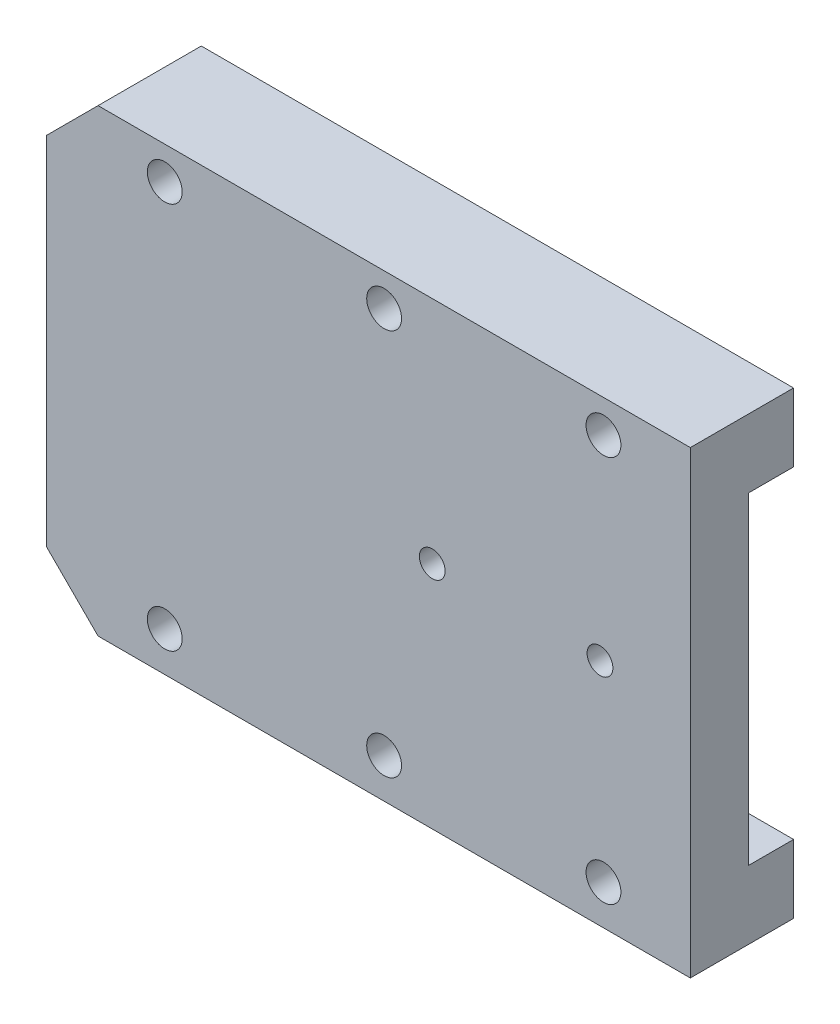
ISO-10303-21;
HEADER;
FILE_DESCRIPTION(('STEP AP214'),'2;1');
FILE_NAME('part.step','',(''),(''),'','','');
FILE_SCHEMA(('AUTOMOTIVE_DESIGN { 1 0 10303 214 1 1 1 1 }'));
ENDSEC;
DATA;
#1=APPLICATION_CONTEXT('core data for automotive mechanical design processes');
#2=APPLICATION_PROTOCOL_DEFINITION('international standard','automotive_design',2000,#1);
#3=PRODUCT_CONTEXT('',#1,'mechanical');
#4=PRODUCT('Part','Part','',(#3));
#5=PRODUCT_RELATED_PRODUCT_CATEGORY('part','',(#4));
#6=PRODUCT_DEFINITION_FORMATION('','',#4);
#7=PRODUCT_DEFINITION_CONTEXT('part definition',#1,'design');
#8=PRODUCT_DEFINITION('design','',#6,#7);
#9=PRODUCT_DEFINITION_SHAPE('','',#8);
#10=(LENGTH_UNIT() NAMED_UNIT(*) SI_UNIT(.MILLI.,.METRE.));
#11=(NAMED_UNIT(*) PLANE_ANGLE_UNIT() SI_UNIT($,.RADIAN.));
#12=(NAMED_UNIT(*) SI_UNIT($,.STERADIAN.) SOLID_ANGLE_UNIT());
#13=UNCERTAINTY_MEASURE_WITH_UNIT(LENGTH_MEASURE(1.E-05),#10,'distance_accuracy_value','');
#14=(GEOMETRIC_REPRESENTATION_CONTEXT(3) GLOBAL_UNCERTAINTY_ASSIGNED_CONTEXT((#13)) GLOBAL_UNIT_ASSIGNED_CONTEXT((#10,
#11,#12)) REPRESENTATION_CONTEXT('',''));
#15=CARTESIAN_POINT('',(0.,0.,0.));
#16=DIRECTION('',(0.,0.,1.));
#17=DIRECTION('',(1.,0.,0.));
#18=AXIS2_PLACEMENT_3D('',#15,#16,#17);
#19=CARTESIAN_POINT('',(0.,0.,-4.));
#20=DIRECTION('',(0.,0.,-1.));
#21=DIRECTION('',(-1.,0.,0.));
#22=AXIS2_PLACEMENT_3D('',#19,#20,#21);
#23=PLANE('',#22);
#24=DIRECTION('',(-1.,0.,0.));
#25=VECTOR('',#24,1.);
#26=CARTESIAN_POINT('',(22.5,12.5,-4.));
#27=LINE('',#26,#25);
#28=CARTESIAN_POINT('',(22.5,12.5,-4.));
#29=VERTEX_POINT('',#28);
#30=CARTESIAN_POINT('',(-27.4,12.5,-4.));
#31=VERTEX_POINT('',#30);
#32=EDGE_CURVE('E170',#29,#31,#27,.T.);
#33=ORIENTED_EDGE('',*,*,#32,.T.);
#34=DIRECTION('',(0.,1.,0.));
#35=VECTOR('',#34,1.);
#36=CARTESIAN_POINT('',(-27.4,17.8,-4.));
#37=LINE('',#36,#35);
#38=CARTESIAN_POINT('',(-27.4,13.8,-4.));
#39=VERTEX_POINT('',#38);
#40=EDGE_CURVE('E173',#31,#39,#37,.T.);
#41=ORIENTED_EDGE('',*,*,#40,.T.);
#42=DIRECTION('',(0.707106781186549,0.707106781186546,0.));
#43=VECTOR('',#42,1.);
#44=CARTESIAN_POINT('',(-20.6,20.6,-4.));
#45=LINE('',#44,#43);
#46=CARTESIAN_POINT('',(-23.4,17.8,-4.));
#47=VERTEX_POINT('',#46);
#48=EDGE_CURVE('E143',#39,#47,#45,.T.);
#49=ORIENTED_EDGE('',*,*,#48,.T.);
#50=DIRECTION('',(-1.,0.,0.));
#51=VECTOR('',#50,1.);
#52=CARTESIAN_POINT('',(22.5,17.8,-4.));
#53=LINE('',#52,#51);
#54=CARTESIAN_POINT('',(22.5,17.8,-4.));
#55=VERTEX_POINT('',#54);
#56=EDGE_CURVE('E121',#55,#47,#53,.T.);
#57=ORIENTED_EDGE('',*,*,#56,.F.);
#58=DIRECTION('',(0.,1.,0.));
#59=VECTOR('',#58,1.);
#60=CARTESIAN_POINT('',(22.5,17.8,-4.));
#61=LINE('',#60,#59);
#62=EDGE_CURVE('E122',#29,#55,#61,.T.);
#63=ORIENTED_EDGE('',*,*,#62,.F.);
#64=EDGE_LOOP('',(#33,#41,#49,#57,#63));
#65=FACE_BOUND('',#64,.T.);
#66=CARTESIAN_POINT('',(-18.2306151546301,15.26709885284,-4.));
#67=DIRECTION('',(0.,0.,-1.));
#68=DIRECTION('',(-1.,0.,0.));
#69=AXIS2_PLACEMENT_3D('',#66,#67,#68);
#70=CIRCLE('',#69,1.35);
#71=CARTESIAN_POINT('',(-19.5806151546301,15.26709885284,-4.));
#72=VERTEX_POINT('',#71);
#73=EDGE_CURVE('E190',#72,#72,#70,.T.);
#74=ORIENTED_EDGE('',*,*,#73,.F.);
#75=EDGE_LOOP('',(#74));
#76=FACE_BOUND('',#75,.T.);
#77=CARTESIAN_POINT('',(-1.23061515463011,15.2670988528399,-4.));
#78=DIRECTION('',(0.,0.,-1.));
#79=DIRECTION('',(-1.,0.,0.));
#80=AXIS2_PLACEMENT_3D('',#77,#78,#79);
#81=CIRCLE('',#80,1.35);
#82=CARTESIAN_POINT('',(-2.58061515463011,15.2670988528399,-4.));
#83=VERTEX_POINT('',#82);
#84=EDGE_CURVE('E184',#83,#83,#81,.T.);
#85=ORIENTED_EDGE('',*,*,#84,.F.);
#86=EDGE_LOOP('',(#85));
#87=FACE_BOUND('',#86,.T.);
#88=CARTESIAN_POINT('',(15.7693848453699,15.2670988528398,-4.));
#89=DIRECTION('',(0.,0.,-1.));
#90=DIRECTION('',(-1.,0.,0.));
#91=AXIS2_PLACEMENT_3D('',#88,#89,#90);
#92=CIRCLE('',#91,1.35);
#93=CARTESIAN_POINT('',(14.4193848453699,15.2670988528398,-4.));
#94=VERTEX_POINT('',#93);
#95=EDGE_CURVE('E179',#94,#94,#92,.T.);
#96=ORIENTED_EDGE('',*,*,#95,.F.);
#97=EDGE_LOOP('',(#96));
#98=FACE_BOUND('',#97,.T.);
#99=ADVANCED_FACE('F16',(#65,#76,#87,#98),#23,.T.);
#100=CARTESIAN_POINT('',(22.5,-17.8,4.));
#101=DIRECTION('',(0.,1.,0.));
#102=DIRECTION('',(-1.,0.,0.));
#103=AXIS2_PLACEMENT_3D('',#100,#101,#102);
#104=PLANE('',#103);
#105=DIRECTION('',(1.,0.,0.));
#106=VECTOR('',#105,1.);
#107=CARTESIAN_POINT('',(22.5,-17.8,4.));
#108=LINE('',#107,#106);
#109=CARTESIAN_POINT('',(-23.4,-17.8,4.));
#110=VERTEX_POINT('',#109);
#111=CARTESIAN_POINT('',(22.5,-17.8,4.));
#112=VERTEX_POINT('',#111);
#113=EDGE_CURVE('E125',#110,#112,#108,.T.);
#114=ORIENTED_EDGE('',*,*,#113,.F.);
#115=DIRECTION('',(0.,0.,-1.));
#116=VECTOR('',#115,1.);
#117=CARTESIAN_POINT('',(-23.4,-17.8,-4.));
#118=LINE('',#117,#116);
#119=CARTESIAN_POINT('',(-23.4,-17.8,-4.));
#120=VERTEX_POINT('',#119);
#121=EDGE_CURVE('E11',#110,#120,#118,.T.);
#122=ORIENTED_EDGE('',*,*,#121,.T.);
#123=DIRECTION('',(1.,0.,0.));
#124=VECTOR('',#123,1.);
#125=CARTESIAN_POINT('',(22.5,-17.8,-4.));
#126=LINE('',#125,#124);
#127=CARTESIAN_POINT('',(22.5,-17.8,-4.));
#128=VERTEX_POINT('',#127);
#129=EDGE_CURVE('E127',#120,#128,#126,.T.);
#130=ORIENTED_EDGE('',*,*,#129,.T.);
#131=DIRECTION('',(0.,0.,-1.));
#132=VECTOR('',#131,1.);
#133=CARTESIAN_POINT('',(22.5,-17.8,4.));
#134=LINE('',#133,#132);
#135=EDGE_CURVE('E120',#112,#128,#134,.T.);
#136=ORIENTED_EDGE('',*,*,#135,.F.);
#137=EDGE_LOOP('',(#114,#122,#130,#136));
#138=FACE_BOUND('',#137,.T.);
#139=ADVANCED_FACE('F238',(#138),#104,.F.);
#140=CARTESIAN_POINT('',(22.5,17.8,4.));
#141=DIRECTION('',(-1.,0.,0.));
#142=DIRECTION('',(0.,0.,1.));
#143=AXIS2_PLACEMENT_3D('',#140,#141,#142);
#144=PLANE('',#143);
#145=DIRECTION('',(0.,1.,0.));
#146=VECTOR('',#145,1.);
#147=CARTESIAN_POINT('',(22.5,12.5,-0.5));
#148=LINE('',#147,#146);
#149=CARTESIAN_POINT('',(22.5,-12.5,-0.5));
#150=VERTEX_POINT('',#149);
#151=CARTESIAN_POINT('',(22.5,12.5,-0.5));
#152=VERTEX_POINT('',#151);
#153=EDGE_CURVE('E102',#150,#152,#148,.T.);
#154=ORIENTED_EDGE('',*,*,#153,.T.);
#155=DIRECTION('',(0.,0.,-1.));
#156=VECTOR('',#155,1.);
#157=CARTESIAN_POINT('',(22.5,12.5,-0.5));
#158=LINE('',#157,#156);
#159=EDGE_CURVE('E114',#152,#29,#158,.T.);
#160=ORIENTED_EDGE('',*,*,#159,.T.);
#161=ORIENTED_EDGE('',*,*,#62,.T.);
#162=DIRECTION('',(0.,0.,-1.));
#163=VECTOR('',#162,1.);
#164=CARTESIAN_POINT('',(22.5,17.8,4.));
#165=LINE('',#164,#163);
#166=CARTESIAN_POINT('',(22.5,17.8,4.));
#167=VERTEX_POINT('',#166);
#168=EDGE_CURVE('E131',#167,#55,#165,.T.);
#169=ORIENTED_EDGE('',*,*,#168,.F.);
#170=DIRECTION('',(0.,1.,0.));
#171=VECTOR('',#170,1.);
#172=CARTESIAN_POINT('',(22.5,17.8,4.));
#173=LINE('',#172,#171);
#174=EDGE_CURVE('E217',#112,#167,#173,.T.);
#175=ORIENTED_EDGE('',*,*,#174,.F.);
#176=ORIENTED_EDGE('',*,*,#135,.T.);
#177=CARTESIAN_POINT('',(22.5,-12.5,-4.));
#178=VERTEX_POINT('',#177);
#179=EDGE_CURVE('E111',#128,#178,#61,.T.);
#180=ORIENTED_EDGE('',*,*,#179,.T.);
#181=DIRECTION('',(0.,0.,1.));
#182=VECTOR('',#181,1.);
#183=CARTESIAN_POINT('',(22.5,-12.5,-0.5));
#184=LINE('',#183,#182);
#185=EDGE_CURVE('E95',#178,#150,#184,.T.);
#186=ORIENTED_EDGE('',*,*,#185,.T.);
#187=EDGE_LOOP('',(#154,#160,#161,#169,#175,#176,#180,#186));
#188=FACE_BOUND('',#187,.T.);
#189=ADVANCED_FACE('F117',(#188),#144,.F.);
#190=CARTESIAN_POINT('',(22.5,17.8,4.));
#191=DIRECTION('',(0.,-1.,0.));
#192=DIRECTION('',(1.,0.,0.));
#193=AXIS2_PLACEMENT_3D('',#190,#191,#192);
#194=PLANE('',#193);
#195=ORIENTED_EDGE('',*,*,#56,.T.);
#196=DIRECTION('',(0.,0.,1.));
#197=VECTOR('',#196,1.);
#198=CARTESIAN_POINT('',(-23.4,17.8,4.));
#199=LINE('',#198,#197);
#200=CARTESIAN_POINT('',(-23.4,17.8,4.));
#201=VERTEX_POINT('',#200);
#202=EDGE_CURVE('E145',#47,#201,#199,.T.);
#203=ORIENTED_EDGE('',*,*,#202,.T.);
#204=DIRECTION('',(-1.,0.,0.));
#205=VECTOR('',#204,1.);
#206=CARTESIAN_POINT('',(22.5,17.8,4.));
#207=LINE('',#206,#205);
#208=EDGE_CURVE('E134',#167,#201,#207,.T.);
#209=ORIENTED_EDGE('',*,*,#208,.F.);
#210=ORIENTED_EDGE('',*,*,#168,.T.);
#211=EDGE_LOOP('',(#195,#203,#209,#210));
#212=FACE_BOUND('',#211,.T.);
#213=ADVANCED_FACE('F248',(#212),#194,.F.);
#214=CARTESIAN_POINT('',(0.,0.,4.));
#215=DIRECTION('',(0.,0.,-1.));
#216=DIRECTION('',(-1.,0.,0.));
#217=AXIS2_PLACEMENT_3D('',#214,#215,#216);
#218=PLANE('',#217);
#219=CARTESIAN_POINT('',(15.5,0.,4.));
#220=DIRECTION('',(0.,0.,1.));
#221=DIRECTION('',(1.,0.,0.));
#222=AXIS2_PLACEMENT_3D('',#219,#220,#221);
#223=CIRCLE('',#222,1.);
#224=CARTESIAN_POINT('',(16.5,0.,4.));
#225=VERTEX_POINT('',#224);
#226=EDGE_CURVE('E161',#225,#225,#223,.T.);
#227=ORIENTED_EDGE('',*,*,#226,.F.);
#228=EDGE_LOOP('',(#227));
#229=FACE_BOUND('',#228,.T.);
#230=CARTESIAN_POINT('',(2.5,0.,4.));
#231=DIRECTION('',(0.,0.,1.));
#232=DIRECTION('',(1.,0.,0.));
#233=AXIS2_PLACEMENT_3D('',#230,#231,#232);
#234=CIRCLE('',#233,1.);
#235=CARTESIAN_POINT('',(3.5,0.,4.));
#236=VERTEX_POINT('',#235);
#237=EDGE_CURVE('E151',#236,#236,#234,.T.);
#238=ORIENTED_EDGE('',*,*,#237,.F.);
#239=EDGE_LOOP('',(#238));
#240=FACE_BOUND('',#239,.T.);
#241=CARTESIAN_POINT('',(15.7693848453699,15.2670988528398,4.));
#242=DIRECTION('',(0.,0.,-1.));
#243=DIRECTION('',(-1.,0.,0.));
#244=AXIS2_PLACEMENT_3D('',#241,#242,#243);
#245=CIRCLE('',#244,1.35);
#246=CARTESIAN_POINT('',(14.4193848453699,15.2670988528398,4.));
#247=VERTEX_POINT('',#246);
#248=EDGE_CURVE('E181',#247,#247,#245,.T.);
#249=ORIENTED_EDGE('',*,*,#248,.T.);
#250=EDGE_LOOP('',(#249));
#251=FACE_BOUND('',#250,.T.);
#252=CARTESIAN_POINT('',(-1.23061515463011,15.2670988528399,4.));
#253=DIRECTION('',(0.,0.,-1.));
#254=DIRECTION('',(-1.,0.,0.));
#255=AXIS2_PLACEMENT_3D('',#252,#253,#254);
#256=CIRCLE('',#255,1.35);
#257=CARTESIAN_POINT('',(-2.58061515463011,15.2670988528399,4.));
#258=VERTEX_POINT('',#257);
#259=EDGE_CURVE('E187',#258,#258,#256,.T.);
#260=ORIENTED_EDGE('',*,*,#259,.T.);
#261=EDGE_LOOP('',(#260));
#262=FACE_BOUND('',#261,.T.);
#263=CARTESIAN_POINT('',(-18.2306151546301,15.26709885284,4.));
#264=DIRECTION('',(0.,0.,-1.));
#265=DIRECTION('',(-1.,0.,0.));
#266=AXIS2_PLACEMENT_3D('',#263,#264,#265);
#267=CIRCLE('',#266,1.35);
#268=CARTESIAN_POINT('',(-19.5806151546301,15.26709885284,4.));
#269=VERTEX_POINT('',#268);
#270=EDGE_CURVE('E193',#269,#269,#267,.T.);
#271=ORIENTED_EDGE('',*,*,#270,.T.);
#272=EDGE_LOOP('',(#271));
#273=FACE_BOUND('',#272,.T.);
#274=CARTESIAN_POINT('',(-18.2306151546302,-14.7329011471601,4.));
#275=DIRECTION('',(0.,0.,-1.));
#276=DIRECTION('',(-1.,0.,0.));
#277=AXIS2_PLACEMENT_3D('',#274,#275,#276);
#278=CIRCLE('',#277,1.35);
#279=CARTESIAN_POINT('',(-19.5806151546302,-14.7329011471601,4.));
#280=VERTEX_POINT('',#279);
#281=EDGE_CURVE('E199',#280,#280,#278,.T.);
#282=ORIENTED_EDGE('',*,*,#281,.T.);
#283=EDGE_LOOP('',(#282));
#284=FACE_BOUND('',#283,.T.);
#285=CARTESIAN_POINT('',(-1.23061515463022,-14.7329011471601,4.));
#286=DIRECTION('',(0.,0.,-1.));
#287=DIRECTION('',(-1.,0.,0.));
#288=AXIS2_PLACEMENT_3D('',#285,#286,#287);
#289=CIRCLE('',#288,1.35);
#290=CARTESIAN_POINT('',(-2.58061515463022,-14.7329011471601,4.));
#291=VERTEX_POINT('',#290);
#292=EDGE_CURVE('E205',#291,#291,#289,.T.);
#293=ORIENTED_EDGE('',*,*,#292,.T.);
#294=EDGE_LOOP('',(#293));
#295=FACE_BOUND('',#294,.T.);
#296=CARTESIAN_POINT('',(15.7693848453698,-14.7329011471602,4.));
#297=DIRECTION('',(0.,0.,-1.));
#298=DIRECTION('',(-1.,0.,0.));
#299=AXIS2_PLACEMENT_3D('',#296,#297,#298);
#300=CIRCLE('',#299,1.35);
#301=CARTESIAN_POINT('',(14.4193848453698,-14.7329011471602,4.));
#302=VERTEX_POINT('',#301);
#303=EDGE_CURVE('E211',#302,#302,#300,.T.);
#304=ORIENTED_EDGE('',*,*,#303,.T.);
#305=EDGE_LOOP('',(#304));
#306=FACE_BOUND('',#305,.T.);
#307=ORIENTED_EDGE('',*,*,#208,.T.);
#308=DIRECTION('',(-0.707106781186549,-0.707106781186546,0.));
#309=VECTOR('',#308,1.);
#310=CARTESIAN_POINT('',(-27.4,13.8,4.));
#311=LINE('',#310,#309);
#312=CARTESIAN_POINT('',(-27.4,13.8,4.));
#313=VERTEX_POINT('',#312);
#314=EDGE_CURVE('E25',#201,#313,#311,.T.);
#315=ORIENTED_EDGE('',*,*,#314,.T.);
#316=DIRECTION('',(0.,-1.,0.));
#317=VECTOR('',#316,1.);
#318=CARTESIAN_POINT('',(-27.4,17.8,4.));
#319=LINE('',#318,#317);
#320=CARTESIAN_POINT('',(-27.4,-13.8,4.));
#321=VERTEX_POINT('',#320);
#322=EDGE_CURVE('E177',#313,#321,#319,.T.);
#323=ORIENTED_EDGE('',*,*,#322,.T.);
#324=DIRECTION('',(0.707106781186547,-0.707106781186548,0.));
#325=VECTOR('',#324,1.);
#326=CARTESIAN_POINT('',(-23.4,-17.8,4.));
#327=LINE('',#326,#325);
#328=EDGE_CURVE('E41',#321,#110,#327,.T.);
#329=ORIENTED_EDGE('',*,*,#328,.T.);
#330=ORIENTED_EDGE('',*,*,#113,.T.);
#331=ORIENTED_EDGE('',*,*,#174,.T.);
#332=EDGE_LOOP('',(#307,#315,#323,#329,#330,#331));
#333=FACE_BOUND('',#332,.T.);
#334=ADVANCED_FACE('F221',(#229,#240,#251,#262,#273,#284,#295,#306,#333),#218,.F.);
#335=DIRECTION('',(-1.,0.,0.));
#336=VECTOR('',#335,1.);
#337=CARTESIAN_POINT('',(22.5,-12.5,-4.));
#338=LINE('',#337,#336);
#339=CARTESIAN_POINT('',(-27.4,-12.5,-4.));
#340=VERTEX_POINT('',#339);
#341=EDGE_CURVE('E33',#178,#340,#338,.T.);
#342=ORIENTED_EDGE('',*,*,#341,.F.);
#343=ORIENTED_EDGE('',*,*,#179,.F.);
#344=ORIENTED_EDGE('',*,*,#129,.F.);
#345=DIRECTION('',(-0.707106781186547,0.707106781186548,0.));
#346=VECTOR('',#345,1.);
#347=CARTESIAN_POINT('',(-20.6,-20.6,-4.));
#348=LINE('',#347,#346);
#349=CARTESIAN_POINT('',(-27.4,-13.8,-4.));
#350=VERTEX_POINT('',#349);
#351=EDGE_CURVE('E141',#120,#350,#348,.T.);
#352=ORIENTED_EDGE('',*,*,#351,.T.);
#353=EDGE_CURVE('E113',#350,#340,#37,.T.);
#354=ORIENTED_EDGE('',*,*,#353,.T.);
#355=EDGE_LOOP('',(#342,#343,#344,#352,#354));
#356=FACE_BOUND('',#355,.T.);
#357=CARTESIAN_POINT('',(-18.2306151546302,-14.7329011471601,-4.));
#358=DIRECTION('',(0.,0.,-1.));
#359=DIRECTION('',(-1.,0.,0.));
#360=AXIS2_PLACEMENT_3D('',#357,#358,#359);
#361=CIRCLE('',#360,1.35);
#362=CARTESIAN_POINT('',(-19.5806151546302,-14.7329011471601,-4.));
#363=VERTEX_POINT('',#362);
#364=EDGE_CURVE('E196',#363,#363,#361,.T.);
#365=ORIENTED_EDGE('',*,*,#364,.F.);
#366=EDGE_LOOP('',(#365));
#367=FACE_BOUND('',#366,.T.);
#368=CARTESIAN_POINT('',(-1.23061515463022,-14.7329011471601,-4.));
#369=DIRECTION('',(0.,0.,-1.));
#370=DIRECTION('',(-1.,0.,0.));
#371=AXIS2_PLACEMENT_3D('',#368,#369,#370);
#372=CIRCLE('',#371,1.35);
#373=CARTESIAN_POINT('',(-2.58061515463022,-14.7329011471601,-4.));
#374=VERTEX_POINT('',#373);
#375=EDGE_CURVE('E202',#374,#374,#372,.T.);
#376=ORIENTED_EDGE('',*,*,#375,.F.);
#377=EDGE_LOOP('',(#376));
#378=FACE_BOUND('',#377,.T.);
#379=CARTESIAN_POINT('',(15.7693848453698,-14.7329011471602,-4.));
#380=DIRECTION('',(0.,0.,-1.));
#381=DIRECTION('',(-1.,0.,0.));
#382=AXIS2_PLACEMENT_3D('',#379,#380,#381);
#383=CIRCLE('',#382,1.35);
#384=CARTESIAN_POINT('',(14.4193848453698,-14.7329011471602,-4.));
#385=VERTEX_POINT('',#384);
#386=EDGE_CURVE('E208',#385,#385,#383,.T.);
#387=ORIENTED_EDGE('',*,*,#386,.F.);
#388=EDGE_LOOP('',(#387));
#389=FACE_BOUND('',#388,.T.);
#390=ADVANCED_FACE('F108',(#356,#367,#378,#389),#23,.T.);
#391=CARTESIAN_POINT('',(15.7693848453698,-14.7329011471602,4.));
#392=DIRECTION('',(0.,0.,-1.));
#393=DIRECTION('',(-1.,0.,0.));
#394=AXIS2_PLACEMENT_3D('',#391,#392,#393);
#395=CYLINDRICAL_SURFACE('',#394,1.35);
#396=ORIENTED_EDGE('',*,*,#303,.F.);
#397=EDGE_LOOP('',(#396));
#398=FACE_BOUND('',#397,.T.);
#399=ORIENTED_EDGE('',*,*,#386,.T.);
#400=EDGE_LOOP('',(#399));
#401=FACE_BOUND('',#400,.T.);
#402=ADVANCED_FACE('F268',(#398,#401),#395,.F.);
#403=CARTESIAN_POINT('',(-1.23061515463022,-14.7329011471601,4.));
#404=DIRECTION('',(0.,0.,-1.));
#405=DIRECTION('',(-1.,0.,0.));
#406=AXIS2_PLACEMENT_3D('',#403,#404,#405);
#407=CYLINDRICAL_SURFACE('',#406,1.35);
#408=ORIENTED_EDGE('',*,*,#292,.F.);
#409=EDGE_LOOP('',(#408));
#410=FACE_BOUND('',#409,.T.);
#411=ORIENTED_EDGE('',*,*,#375,.T.);
#412=EDGE_LOOP('',(#411));
#413=FACE_BOUND('',#412,.T.);
#414=ADVANCED_FACE('F273',(#410,#413),#407,.F.);
#415=CARTESIAN_POINT('',(-18.2306151546302,-14.7329011471601,4.));
#416=DIRECTION('',(0.,0.,-1.));
#417=DIRECTION('',(-1.,0.,0.));
#418=AXIS2_PLACEMENT_3D('',#415,#416,#417);
#419=CYLINDRICAL_SURFACE('',#418,1.35);
#420=ORIENTED_EDGE('',*,*,#281,.F.);
#421=EDGE_LOOP('',(#420));
#422=FACE_BOUND('',#421,.T.);
#423=ORIENTED_EDGE('',*,*,#364,.T.);
#424=EDGE_LOOP('',(#423));
#425=FACE_BOUND('',#424,.T.);
#426=ADVANCED_FACE('F280',(#422,#425),#419,.F.);
#427=CARTESIAN_POINT('',(-18.2306151546301,15.26709885284,4.));
#428=DIRECTION('',(0.,0.,-1.));
#429=DIRECTION('',(-1.,0.,0.));
#430=AXIS2_PLACEMENT_3D('',#427,#428,#429);
#431=CYLINDRICAL_SURFACE('',#430,1.35);
#432=ORIENTED_EDGE('',*,*,#270,.F.);
#433=EDGE_LOOP('',(#432));
#434=FACE_BOUND('',#433,.T.);
#435=ORIENTED_EDGE('',*,*,#73,.T.);
#436=EDGE_LOOP('',(#435));
#437=FACE_BOUND('',#436,.T.);
#438=ADVANCED_FACE('F288',(#434,#437),#431,.F.);
#439=CARTESIAN_POINT('',(-1.23061515463011,15.2670988528399,4.));
#440=DIRECTION('',(0.,0.,-1.));
#441=DIRECTION('',(-1.,0.,0.));
#442=AXIS2_PLACEMENT_3D('',#439,#440,#441);
#443=CYLINDRICAL_SURFACE('',#442,1.35);
#444=ORIENTED_EDGE('',*,*,#259,.F.);
#445=EDGE_LOOP('',(#444));
#446=FACE_BOUND('',#445,.T.);
#447=ORIENTED_EDGE('',*,*,#84,.T.);
#448=EDGE_LOOP('',(#447));
#449=FACE_BOUND('',#448,.T.);
#450=ADVANCED_FACE('F292',(#446,#449),#443,.F.);
#451=CARTESIAN_POINT('',(15.7693848453699,15.2670988528398,4.));
#452=DIRECTION('',(0.,0.,-1.));
#453=DIRECTION('',(-1.,0.,0.));
#454=AXIS2_PLACEMENT_3D('',#451,#452,#453);
#455=CYLINDRICAL_SURFACE('',#454,1.35);
#456=ORIENTED_EDGE('',*,*,#248,.F.);
#457=EDGE_LOOP('',(#456));
#458=FACE_BOUND('',#457,.T.);
#459=ORIENTED_EDGE('',*,*,#95,.T.);
#460=EDGE_LOOP('',(#459));
#461=FACE_BOUND('',#460,.T.);
#462=ADVANCED_FACE('F296',(#458,#461),#455,.F.);
#463=CARTESIAN_POINT('',(-27.4,17.8,39.9356369082281));
#464=DIRECTION('',(-1.,0.,0.));
#465=DIRECTION('',(0.,-1.,0.));
#466=AXIS2_PLACEMENT_3D('',#463,#464,#465);
#467=PLANE('',#466);
#468=DIRECTION('',(0.,0.,-1.));
#469=VECTOR('',#468,1.);
#470=CARTESIAN_POINT('',(-27.4,12.5,-0.5));
#471=LINE('',#470,#469);
#472=CARTESIAN_POINT('',(-27.4,12.5,-0.5));
#473=VERTEX_POINT('',#472);
#474=EDGE_CURVE('E103',#473,#31,#471,.T.);
#475=ORIENTED_EDGE('',*,*,#474,.F.);
#476=DIRECTION('',(0.,1.,0.));
#477=VECTOR('',#476,1.);
#478=CARTESIAN_POINT('',(-27.4,12.5,-0.5));
#479=LINE('',#478,#477);
#480=CARTESIAN_POINT('',(-27.4,-12.5,-0.5));
#481=VERTEX_POINT('',#480);
#482=EDGE_CURVE('E154',#481,#473,#479,.T.);
#483=ORIENTED_EDGE('',*,*,#482,.F.);
#484=DIRECTION('',(0.,0.,1.));
#485=VECTOR('',#484,1.);
#486=CARTESIAN_POINT('',(-27.4,-12.5,-0.5));
#487=LINE('',#486,#485);
#488=EDGE_CURVE('E150',#340,#481,#487,.T.);
#489=ORIENTED_EDGE('',*,*,#488,.F.);
#490=ORIENTED_EDGE('',*,*,#353,.F.);
#491=DIRECTION('',(0.,0.,1.));
#492=VECTOR('',#491,1.);
#493=CARTESIAN_POINT('',(-27.4,-13.8,4.));
#494=LINE('',#493,#492);
#495=EDGE_CURVE('E136',#350,#321,#494,.T.);
#496=ORIENTED_EDGE('',*,*,#495,.T.);
#497=ORIENTED_EDGE('',*,*,#322,.F.);
#498=DIRECTION('',(0.,0.,-1.));
#499=VECTOR('',#498,1.);
#500=CARTESIAN_POINT('',(-27.4,13.8,-4.));
#501=LINE('',#500,#499);
#502=EDGE_CURVE('E138',#313,#39,#501,.T.);
#503=ORIENTED_EDGE('',*,*,#502,.T.);
#504=ORIENTED_EDGE('',*,*,#40,.F.);
#505=EDGE_LOOP('',(#475,#483,#489,#490,#496,#497,#503,#504));
#506=FACE_BOUND('',#505,.T.);
#507=ADVANCED_FACE('F233',(#506),#467,.T.);
#508=CARTESIAN_POINT('',(-27.4,13.8,39.9356369082281));
#509=DIRECTION('',(-0.707106781186546,0.707106781186549,0.));
#510=DIRECTION('',(0.,0.,1.));
#511=AXIS2_PLACEMENT_3D('',#508,#509,#510);
#512=PLANE('',#511);
#513=ORIENTED_EDGE('',*,*,#314,.F.);
#514=ORIENTED_EDGE('',*,*,#202,.F.);
#515=ORIENTED_EDGE('',*,*,#48,.F.);
#516=ORIENTED_EDGE('',*,*,#502,.F.);
#517=EDGE_LOOP('',(#513,#514,#515,#516));
#518=FACE_BOUND('',#517,.T.);
#519=ADVANCED_FACE('F228',(#518),#512,.T.);
#520=CARTESIAN_POINT('',(-23.4,-17.8,4.));
#521=DIRECTION('',(-0.707106781186548,-0.707106781186547,0.));
#522=DIRECTION('',(0.,0.,1.));
#523=AXIS2_PLACEMENT_3D('',#520,#521,#522);
#524=PLANE('',#523);
#525=ORIENTED_EDGE('',*,*,#328,.F.);
#526=ORIENTED_EDGE('',*,*,#495,.F.);
#527=ORIENTED_EDGE('',*,*,#351,.F.);
#528=ORIENTED_EDGE('',*,*,#121,.F.);
#529=EDGE_LOOP('',(#525,#526,#527,#528));
#530=FACE_BOUND('',#529,.T.);
#531=ADVANCED_FACE('F18',(#530),#524,.T.);
#532=CARTESIAN_POINT('',(22.5,12.5,-0.5));
#533=DIRECTION('',(0.,1.,0.));
#534=DIRECTION('',(-1.,0.,0.));
#535=AXIS2_PLACEMENT_3D('',#532,#533,#534);
#536=PLANE('',#535);
#537=ORIENTED_EDGE('',*,*,#474,.T.);
#538=ORIENTED_EDGE('',*,*,#32,.F.);
#539=ORIENTED_EDGE('',*,*,#159,.F.);
#540=DIRECTION('',(-1.,0.,0.));
#541=VECTOR('',#540,1.);
#542=CARTESIAN_POINT('',(22.5,12.5,-0.5));
#543=LINE('',#542,#541);
#544=EDGE_CURVE('E174',#152,#473,#543,.T.);
#545=ORIENTED_EDGE('',*,*,#544,.T.);
#546=EDGE_LOOP('',(#537,#538,#539,#545));
#547=FACE_BOUND('',#546,.T.);
#548=ADVANCED_FACE('F308',(#547),#536,.F.);
#549=CARTESIAN_POINT('',(22.5,12.5,-0.5));
#550=DIRECTION('',(0.,0.,1.));
#551=DIRECTION('',(0.,-1.,0.));
#552=AXIS2_PLACEMENT_3D('',#549,#550,#551);
#553=PLANE('',#552);
#554=CARTESIAN_POINT('',(15.5,0.,-0.5));
#555=DIRECTION('',(0.,0.,1.));
#556=DIRECTION('',(0.,-1.,0.));
#557=AXIS2_PLACEMENT_3D('',#554,#555,#556);
#558=CIRCLE('',#557,1.);
#559=CARTESIAN_POINT('',(15.5,-1.,-0.5));
#560=VERTEX_POINT('',#559);
#561=EDGE_CURVE('E20',#560,#560,#558,.T.);
#562=ORIENTED_EDGE('',*,*,#561,.T.);
#563=EDGE_LOOP('',(#562));
#564=FACE_BOUND('',#563,.T.);
#565=CARTESIAN_POINT('',(2.5,0.,-0.5));
#566=DIRECTION('',(0.,0.,1.));
#567=DIRECTION('',(0.,-1.,0.));
#568=AXIS2_PLACEMENT_3D('',#565,#566,#567);
#569=CIRCLE('',#568,1.);
#570=CARTESIAN_POINT('',(2.5,-1.,-0.5));
#571=VERTEX_POINT('',#570);
#572=EDGE_CURVE('E148',#571,#571,#569,.T.);
#573=ORIENTED_EDGE('',*,*,#572,.T.);
#574=EDGE_LOOP('',(#573));
#575=FACE_BOUND('',#574,.T.);
#576=ORIENTED_EDGE('',*,*,#482,.T.);
#577=ORIENTED_EDGE('',*,*,#544,.F.);
#578=ORIENTED_EDGE('',*,*,#153,.F.);
#579=DIRECTION('',(-1.,0.,0.));
#580=VECTOR('',#579,1.);
#581=CARTESIAN_POINT('',(22.5,-12.5,-0.5));
#582=LINE('',#581,#580);
#583=EDGE_CURVE('E97',#150,#481,#582,.T.);
#584=ORIENTED_EDGE('',*,*,#583,.T.);
#585=EDGE_LOOP('',(#576,#577,#578,#584));
#586=FACE_BOUND('',#585,.T.);
#587=ADVANCED_FACE('F241',(#564,#575,#586),#553,.F.);
#588=CARTESIAN_POINT('',(22.5,-12.5,-0.5));
#589=DIRECTION('',(0.,-1.,0.));
#590=DIRECTION('',(1.,0.,0.));
#591=AXIS2_PLACEMENT_3D('',#588,#589,#590);
#592=PLANE('',#591);
#593=ORIENTED_EDGE('',*,*,#488,.T.);
#594=ORIENTED_EDGE('',*,*,#583,.F.);
#595=ORIENTED_EDGE('',*,*,#185,.F.);
#596=ORIENTED_EDGE('',*,*,#341,.T.);
#597=EDGE_LOOP('',(#593,#594,#595,#596));
#598=FACE_BOUND('',#597,.T.);
#599=ADVANCED_FACE('F96',(#598),#592,.F.);
#600=CARTESIAN_POINT('',(2.5,0.,-4.));
#601=DIRECTION('',(0.,0.,1.));
#602=DIRECTION('',(1.,0.,0.));
#603=AXIS2_PLACEMENT_3D('',#600,#601,#602);
#604=CYLINDRICAL_SURFACE('',#603,1.);
#605=ORIENTED_EDGE('',*,*,#237,.T.);
#606=EDGE_LOOP('',(#605));
#607=FACE_BOUND('',#606,.T.);
#608=ORIENTED_EDGE('',*,*,#572,.F.);
#609=EDGE_LOOP('',(#608));
#610=FACE_BOUND('',#609,.T.);
#611=ADVANCED_FACE('F305',(#607,#610),#604,.F.);
#612=CARTESIAN_POINT('',(15.5,0.,-4.));
#613=DIRECTION('',(0.,0.,1.));
#614=DIRECTION('',(1.,0.,0.));
#615=AXIS2_PLACEMENT_3D('',#612,#613,#614);
#616=CYLINDRICAL_SURFACE('',#615,1.);
#617=ORIENTED_EDGE('',*,*,#226,.T.);
#618=EDGE_LOOP('',(#617));
#619=FACE_BOUND('',#618,.T.);
#620=ORIENTED_EDGE('',*,*,#561,.F.);
#621=EDGE_LOOP('',(#620));
#622=FACE_BOUND('',#621,.T.);
#623=ADVANCED_FACE('F314',(#619,#622),#616,.F.);
#624=CLOSED_SHELL('',(#99,#139,#189,#213,#334,#390,#402,#414,#426,#438,#450,#462,#507,#519,#531,
#548,#587,#599,#611,#623));
#625=MANIFOLD_SOLID_BREP('B1',#624);
#626=ADVANCED_BREP_SHAPE_REPRESENTATION('',(#18,#625),#14);
#627=SHAPE_DEFINITION_REPRESENTATION(#9,#626);
ENDSEC;
END-ISO-10303-21;
